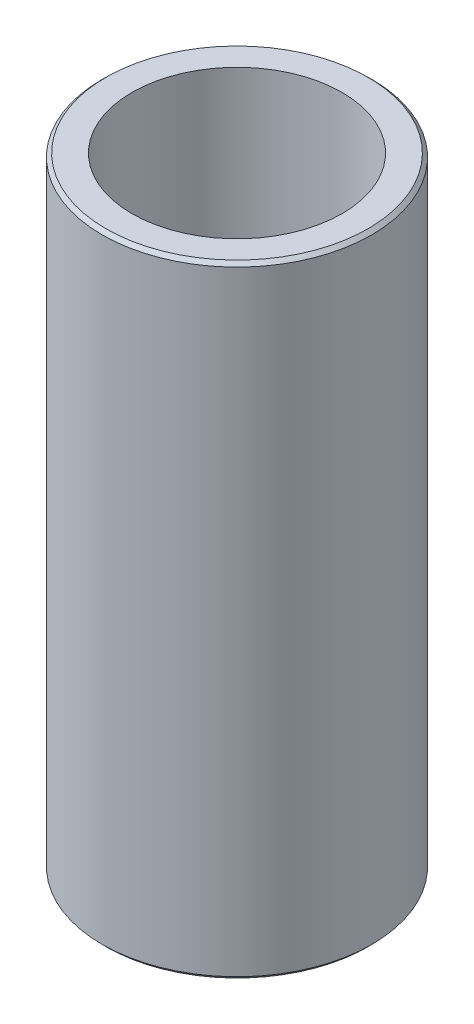
ISO-10303-21;
HEADER;
FILE_DESCRIPTION(('STEP AP214'),'2;1');
FILE_NAME('part.step','',(''),(''),'','','');
FILE_SCHEMA(('AUTOMOTIVE_DESIGN { 1 0 10303 214 1 1 1 1 }'));
ENDSEC;
DATA;
#1=APPLICATION_CONTEXT('core data for automotive mechanical design processes');
#2=APPLICATION_PROTOCOL_DEFINITION('international standard','automotive_design',2000,#1);
#3=PRODUCT_CONTEXT('',#1,'mechanical');
#4=PRODUCT('Part','Part','',(#3));
#5=PRODUCT_RELATED_PRODUCT_CATEGORY('part','',(#4));
#6=PRODUCT_DEFINITION_FORMATION('','',#4);
#7=PRODUCT_DEFINITION_CONTEXT('part definition',#1,'design');
#8=PRODUCT_DEFINITION('design','',#6,#7);
#9=PRODUCT_DEFINITION_SHAPE('','',#8);
#10=(LENGTH_UNIT() NAMED_UNIT(*) SI_UNIT(.MILLI.,.METRE.));
#11=(NAMED_UNIT(*) PLANE_ANGLE_UNIT() SI_UNIT($,.RADIAN.));
#12=(NAMED_UNIT(*) SI_UNIT($,.STERADIAN.) SOLID_ANGLE_UNIT());
#13=UNCERTAINTY_MEASURE_WITH_UNIT(LENGTH_MEASURE(1.E-05),#10,'distance_accuracy_value','');
#14=(GEOMETRIC_REPRESENTATION_CONTEXT(3) GLOBAL_UNCERTAINTY_ASSIGNED_CONTEXT((#13)) GLOBAL_UNIT_ASSIGNED_CONTEXT((#10,
#11,#12)) REPRESENTATION_CONTEXT('',''));
#15=CARTESIAN_POINT('',(0.,0.,0.));
#16=DIRECTION('',(0.,0.,1.));
#17=DIRECTION('',(1.,0.,0.));
#18=AXIS2_PLACEMENT_3D('',#15,#16,#17);
#19=CARTESIAN_POINT('',(0.,138.411285042921,0.));
#20=DIRECTION('',(0.,-1.,0.));
#21=DIRECTION('',(0.,0.,-1.));
#22=AXIS2_PLACEMENT_3D('',#19,#20,#21);
#23=CYLINDRICAL_SURFACE('',#22,30.);
#24=CARTESIAN_POINT('',(0.,137.628739985924,0.));
#25=DIRECTION('',(0.,1.,0.));
#26=DIRECTION('',(0.,0.,1.));
#27=AXIS2_PLACEMENT_3D('',#24,#25,#26);
#28=CIRCLE('',#27,30.);
#29=CARTESIAN_POINT('',(0.,137.628739985924,30.));
#30=VERTEX_POINT('',#29);
#31=EDGE_CURVE('E50',#30,#30,#28,.F.);
#32=ORIENTED_EDGE('',*,*,#31,.T.);
#33=EDGE_LOOP('',(#32));
#34=FACE_BOUND('',#33,.T.);
#35=CARTESIAN_POINT('',(0.,0.812186500555867,0.));
#36=DIRECTION('',(0.,1.,0.));
#37=DIRECTION('',(0.,0.,1.));
#38=AXIS2_PLACEMENT_3D('',#35,#36,#37);
#39=CIRCLE('',#38,30.);
#40=CARTESIAN_POINT('',(0.,0.812186500555867,30.));
#41=VERTEX_POINT('',#40);
#42=EDGE_CURVE('E51',#41,#41,#39,.T.);
#43=ORIENTED_EDGE('',*,*,#42,.T.);
#44=EDGE_LOOP('',(#43));
#45=FACE_BOUND('',#44,.T.);
#46=ADVANCED_FACE('F39',(#34,#45),#23,.T.);
#47=CARTESIAN_POINT('',(0.,138.411285042921,0.));
#48=DIRECTION('',(0.,1.,0.));
#49=DIRECTION('',(0.,0.,1.));
#50=AXIS2_PLACEMENT_3D('',#47,#48,#49);
#51=PLANE('',#50);
#52=CARTESIAN_POINT('',(0.,138.411285042921,0.));
#53=DIRECTION('',(0.,1.,0.));
#54=DIRECTION('',(0.,0.,1.));
#55=AXIS2_PLACEMENT_3D('',#52,#53,#54);
#56=CIRCLE('',#55,29.1878134994441);
#57=CARTESIAN_POINT('',(0.,138.411285042921,29.1878134994441));
#58=VERTEX_POINT('',#57);
#59=EDGE_CURVE('E54',#58,#58,#56,.T.);
#60=ORIENTED_EDGE('',*,*,#59,.T.);
#61=EDGE_LOOP('',(#60));
#62=FACE_BOUND('',#61,.T.);
#63=CARTESIAN_POINT('',(0.,138.411285042921,0.));
#64=DIRECTION('',(0.,1.,0.));
#65=DIRECTION('',(0.,0.,1.));
#66=AXIS2_PLACEMENT_3D('',#63,#64,#65);
#67=CIRCLE('',#66,23.390178152438);
#68=CARTESIAN_POINT('',(0.,138.411285042921,23.390178152438));
#69=VERTEX_POINT('',#68);
#70=EDGE_CURVE('E58',#69,#69,#67,.T.);
#71=ORIENTED_EDGE('',*,*,#70,.F.);
#72=EDGE_LOOP('',(#71));
#73=FACE_BOUND('',#72,.T.);
#74=ADVANCED_FACE('F69',(#62,#73),#51,.T.);
#75=CARTESIAN_POINT('',(0.,0.,0.));
#76=DIRECTION('',(0.,1.,0.));
#77=DIRECTION('',(0.,0.,1.));
#78=AXIS2_PLACEMENT_3D('',#75,#76,#77);
#79=PLANE('',#78);
#80=CARTESIAN_POINT('',(0.,0.,0.));
#81=DIRECTION('',(0.,1.,0.));
#82=DIRECTION('',(0.,0.,1.));
#83=AXIS2_PLACEMENT_3D('',#80,#81,#82);
#84=CIRCLE('',#83,29.2174549430032);
#85=CARTESIAN_POINT('',(0.,0.,29.2174549430032));
#86=VERTEX_POINT('',#85);
#87=EDGE_CURVE('E10',#86,#86,#84,.F.);
#88=ORIENTED_EDGE('',*,*,#87,.T.);
#89=EDGE_LOOP('',(#88));
#90=FACE_BOUND('',#89,.T.);
#91=CARTESIAN_POINT('',(0.,0.,0.));
#92=DIRECTION('',(0.,1.,0.));
#93=DIRECTION('',(0.,0.,1.));
#94=AXIS2_PLACEMENT_3D('',#91,#92,#93);
#95=CIRCLE('',#94,23.390178152438);
#96=CARTESIAN_POINT('',(0.,0.,23.390178152438));
#97=VERTEX_POINT('',#96);
#98=EDGE_CURVE('E63',#97,#97,#95,.T.);
#99=ORIENTED_EDGE('',*,*,#98,.T.);
#100=EDGE_LOOP('',(#99));
#101=FACE_BOUND('',#100,.T.);
#102=ADVANCED_FACE('F75',(#90,#101),#79,.F.);
#103=CARTESIAN_POINT('',(0.,138.411285042921,0.));
#104=DIRECTION('',(0.,-1.,0.));
#105=DIRECTION('',(0.,0.,-1.));
#106=AXIS2_PLACEMENT_3D('',#103,#104,#105);
#107=CYLINDRICAL_SURFACE('',#106,23.390178152438);
#108=ORIENTED_EDGE('',*,*,#70,.T.);
#109=EDGE_LOOP('',(#108));
#110=FACE_BOUND('',#109,.T.);
#111=ORIENTED_EDGE('',*,*,#98,.F.);
#112=EDGE_LOOP('',(#111));
#113=FACE_BOUND('',#112,.T.);
#114=ADVANCED_FACE('F70',(#110,#113),#107,.F.);
#115=CARTESIAN_POINT('',(0.,138.411285042921,0.));
#116=DIRECTION('',(0.,-1.,0.));
#117=DIRECTION('',(0.,0.,-1.));
#118=AXIS2_PLACEMENT_3D('',#115,#116,#117);
#119=CONICAL_SURFACE('',#118,29.1878134994441,0.803983128755807);
#120=ORIENTED_EDGE('',*,*,#31,.F.);
#121=EDGE_LOOP('',(#120));
#122=FACE_BOUND('',#121,.T.);
#123=ORIENTED_EDGE('',*,*,#59,.F.);
#124=EDGE_LOOP('',(#123));
#125=FACE_BOUND('',#124,.T.);
#126=ADVANCED_FACE('F81',(#122,#125),#119,.T.);
#127=CARTESIAN_POINT('',(0.,0.812186500555867,0.));
#128=DIRECTION('',(0.,1.,0.));
#129=DIRECTION('',(0.,0.,1.));
#130=AXIS2_PLACEMENT_3D('',#127,#128,#129);
#131=CONICAL_SURFACE('',#130,30.,0.766813198039054);
#132=ORIENTED_EDGE('',*,*,#87,.F.);
#133=EDGE_LOOP('',(#132));
#134=FACE_BOUND('',#133,.T.);
#135=ORIENTED_EDGE('',*,*,#42,.F.);
#136=EDGE_LOOP('',(#135));
#137=FACE_BOUND('',#136,.T.);
#138=ADVANCED_FACE('F45',(#134,#137),#131,.T.);
#139=CLOSED_SHELL('',(#46,#74,#102,#114,#126,#138));
#140=MANIFOLD_SOLID_BREP('B2',#139);
#141=ADVANCED_BREP_SHAPE_REPRESENTATION('',(#18,#140),#14);
#142=SHAPE_DEFINITION_REPRESENTATION(#9,#141);
ENDSEC;
END-ISO-10303-21;
